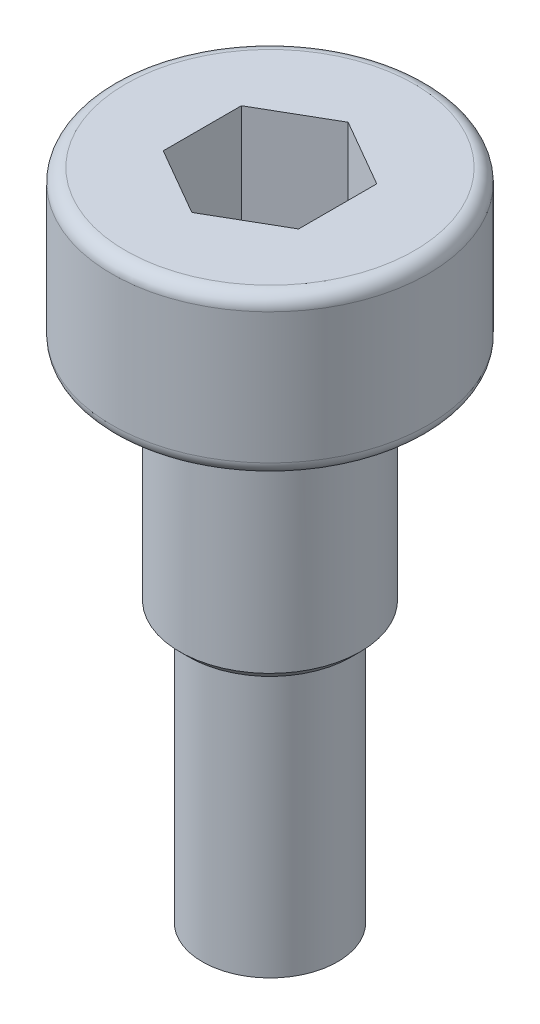
ISO-10303-21;
HEADER;
FILE_DESCRIPTION(('STEP AP214'),'2;1');
FILE_NAME('part.step','',(''),(''),'','','');
FILE_SCHEMA(('AUTOMOTIVE_DESIGN { 1 0 10303 214 1 1 1 1 }'));
ENDSEC;
DATA;
#1=APPLICATION_CONTEXT('core data for automotive mechanical design processes');
#2=APPLICATION_PROTOCOL_DEFINITION('international standard','automotive_design',2000,#1);
#3=PRODUCT_CONTEXT('',#1,'mechanical');
#4=PRODUCT('Part','Part','',(#3));
#5=PRODUCT_RELATED_PRODUCT_CATEGORY('part','',(#4));
#6=PRODUCT_DEFINITION_FORMATION('','',#4);
#7=PRODUCT_DEFINITION_CONTEXT('part definition',#1,'design');
#8=PRODUCT_DEFINITION('design','',#6,#7);
#9=PRODUCT_DEFINITION_SHAPE('','',#8);
#10=(LENGTH_UNIT() NAMED_UNIT(*) SI_UNIT(.MILLI.,.METRE.));
#11=(NAMED_UNIT(*) PLANE_ANGLE_UNIT() SI_UNIT($,.RADIAN.));
#12=(NAMED_UNIT(*) SI_UNIT($,.STERADIAN.) SOLID_ANGLE_UNIT());
#13=UNCERTAINTY_MEASURE_WITH_UNIT(LENGTH_MEASURE(1.E-05),#10,'distance_accuracy_value','');
#14=(GEOMETRIC_REPRESENTATION_CONTEXT(3) GLOBAL_UNCERTAINTY_ASSIGNED_CONTEXT((#13)) GLOBAL_UNIT_ASSIGNED_CONTEXT((#10,
#11,#12)) REPRESENTATION_CONTEXT('',''));
#15=CARTESIAN_POINT('',(0.,0.,0.));
#16=DIRECTION('',(0.,0.,1.));
#17=DIRECTION('',(1.,0.,0.));
#18=AXIS2_PLACEMENT_3D('',#15,#16,#17);
#19=CARTESIAN_POINT('',(0.,3.5,0.));
#20=DIRECTION('',(0.,1.,0.));
#21=DIRECTION('',(-1.,0.,0.));
#22=AXIS2_PLACEMENT_3D('',#19,#20,#21);
#23=PLANE('',#22);
#24=DIRECTION('',(0.,0.,-1.));
#25=VECTOR('',#24,1.);
#26=CARTESIAN_POINT('',(1.5,3.5,0.866025403784437));
#27=LINE('',#26,#25);
#28=CARTESIAN_POINT('',(1.5,3.5,0.866025403784437));
#29=VERTEX_POINT('',#28);
#30=CARTESIAN_POINT('',(1.5,3.5,-0.866025403784439));
#31=VERTEX_POINT('',#30);
#32=EDGE_CURVE('E64',#29,#31,#27,.T.);
#33=ORIENTED_EDGE('',*,*,#32,.F.);
#34=DIRECTION('',(0.866025403784439,0.,-0.5));
#35=VECTOR('',#34,1.);
#36=CARTESIAN_POINT('',(0.,3.5,1.73205080756888));
#37=LINE('',#36,#35);
#38=CARTESIAN_POINT('',(0.,3.5,1.73205080756888));
#39=VERTEX_POINT('',#38);
#40=EDGE_CURVE('E157',#39,#29,#37,.T.);
#41=ORIENTED_EDGE('',*,*,#40,.F.);
#42=DIRECTION('',(0.866025403784439,0.,0.5));
#43=VECTOR('',#42,1.);
#44=CARTESIAN_POINT('',(-1.5,3.5,0.866025403784438));
#45=LINE('',#44,#43);
#46=CARTESIAN_POINT('',(-1.5,3.5,0.866025403784438));
#47=VERTEX_POINT('',#46);
#48=EDGE_CURVE('E154',#47,#39,#45,.T.);
#49=ORIENTED_EDGE('',*,*,#48,.F.);
#50=DIRECTION('',(0.,0.,1.));
#51=VECTOR('',#50,1.);
#52=CARTESIAN_POINT('',(-1.5,3.5,-0.866025403784438));
#53=LINE('',#52,#51);
#54=CARTESIAN_POINT('',(-1.5,3.5,-0.866025403784438));
#55=VERTEX_POINT('',#54);
#56=EDGE_CURVE('E112',#55,#47,#53,.T.);
#57=ORIENTED_EDGE('',*,*,#56,.F.);
#58=DIRECTION('',(-0.866025403784439,0.,0.5));
#59=VECTOR('',#58,1.);
#60=CARTESIAN_POINT('',(0.,3.5,-1.73205080756888));
#61=LINE('',#60,#59);
#62=CARTESIAN_POINT('',(0.,3.5,-1.73205080756888));
#63=VERTEX_POINT('',#62);
#64=EDGE_CURVE('E148',#63,#55,#61,.T.);
#65=ORIENTED_EDGE('',*,*,#64,.F.);
#66=DIRECTION('',(-0.866025403784439,0.,-0.5));
#67=VECTOR('',#66,1.);
#68=CARTESIAN_POINT('',(1.5,3.5,-0.866025403784439));
#69=LINE('',#68,#67);
#70=EDGE_CURVE('E144',#31,#63,#69,.T.);
#71=ORIENTED_EDGE('',*,*,#70,.F.);
#72=EDGE_LOOP('',(#33,#41,#49,#57,#65,#71));
#73=FACE_BOUND('',#72,.T.);
#74=CARTESIAN_POINT('',(0.,3.5,0.));
#75=DIRECTION('',(0.,1.,0.));
#76=DIRECTION('',(-1.,0.,0.));
#77=AXIS2_PLACEMENT_3D('',#74,#75,#76);
#78=CIRCLE('',#77,3.2);
#79=CARTESIAN_POINT('',(-3.2,3.5,0.));
#80=VERTEX_POINT('',#79);
#81=EDGE_CURVE('E196',#80,#80,#78,.T.);
#82=ORIENTED_EDGE('',*,*,#81,.T.);
#83=EDGE_LOOP('',(#82));
#84=FACE_BOUND('',#83,.T.);
#85=ADVANCED_FACE('F47',(#73,#84),#23,.T.);
#86=CARTESIAN_POINT('',(0.,3.5,0.));
#87=DIRECTION('',(0.,1.,0.));
#88=DIRECTION('',(-1.,0.,0.));
#89=AXIS2_PLACEMENT_3D('',#86,#87,#88);
#90=CYLINDRICAL_SURFACE('',#89,3.5);
#91=CARTESIAN_POINT('',(0.,0.3,0.));
#92=DIRECTION('',(0.,-1.,0.));
#93=DIRECTION('',(1.,0.,0.));
#94=AXIS2_PLACEMENT_3D('',#91,#92,#93);
#95=CIRCLE('',#94,3.5);
#96=CARTESIAN_POINT('',(3.5,0.300000000000001,0.));
#97=VERTEX_POINT('',#96);
#98=EDGE_CURVE('E188',#97,#97,#95,.F.);
#99=ORIENTED_EDGE('',*,*,#98,.T.);
#100=EDGE_LOOP('',(#99));
#101=FACE_BOUND('',#100,.T.);
#102=CARTESIAN_POINT('',(0.,3.2,0.));
#103=DIRECTION('',(0.,1.,0.));
#104=DIRECTION('',(-1.,0.,0.));
#105=AXIS2_PLACEMENT_3D('',#102,#103,#104);
#106=CIRCLE('',#105,3.5);
#107=CARTESIAN_POINT('',(-3.5,3.2,0.));
#108=VERTEX_POINT('',#107);
#109=EDGE_CURVE('E184',#108,#108,#106,.F.);
#110=ORIENTED_EDGE('',*,*,#109,.T.);
#111=EDGE_LOOP('',(#110));
#112=FACE_BOUND('',#111,.T.);
#113=ADVANCED_FACE('F215',(#101,#112),#90,.T.);
#114=CARTESIAN_POINT('',(-3.5,0.,0.));
#115=DIRECTION('',(0.,-1.,0.));
#116=DIRECTION('',(1.,0.,0.));
#117=AXIS2_PLACEMENT_3D('',#114,#115,#116);
#118=PLANE('',#117);
#119=CARTESIAN_POINT('',(0.,0.,0.));
#120=DIRECTION('',(0.,-1.,0.));
#121=DIRECTION('',(1.,0.,0.));
#122=AXIS2_PLACEMENT_3D('',#119,#120,#121);
#123=CIRCLE('',#122,3.2);
#124=CARTESIAN_POINT('',(3.2,0.,0.));
#125=VERTEX_POINT('',#124);
#126=EDGE_CURVE('E192',#125,#125,#123,.T.);
#127=ORIENTED_EDGE('',*,*,#126,.T.);
#128=EDGE_LOOP('',(#127));
#129=FACE_BOUND('',#128,.T.);
#130=CARTESIAN_POINT('',(0.,0.,0.));
#131=DIRECTION('',(0.,1.,0.));
#132=DIRECTION('',(-1.,0.,0.));
#133=AXIS2_PLACEMENT_3D('',#130,#131,#132);
#134=CIRCLE('',#133,2.);
#135=CARTESIAN_POINT('',(-2.,0.,0.));
#136=VERTEX_POINT('',#135);
#137=EDGE_CURVE('E180',#136,#136,#134,.T.);
#138=ORIENTED_EDGE('',*,*,#137,.T.);
#139=EDGE_LOOP('',(#138));
#140=FACE_BOUND('',#139,.T.);
#141=ADVANCED_FACE('F221',(#129,#140),#118,.T.);
#142=CARTESIAN_POINT('',(0.,3.5,0.));
#143=DIRECTION('',(0.,1.,0.));
#144=DIRECTION('',(-1.,0.,0.));
#145=AXIS2_PLACEMENT_3D('',#142,#143,#144);
#146=CYLINDRICAL_SURFACE('',#145,2.);
#147=CARTESIAN_POINT('',(0.,-4.8,0.));
#148=DIRECTION('',(0.,-1.,0.));
#149=DIRECTION('',(1.,0.,0.));
#150=AXIS2_PLACEMENT_3D('',#147,#148,#149);
#151=CIRCLE('',#150,2.);
#152=CARTESIAN_POINT('',(2.,-4.8,0.));
#153=VERTEX_POINT('',#152);
#154=EDGE_CURVE('E57',#153,#153,#151,.F.);
#155=ORIENTED_EDGE('',*,*,#154,.T.);
#156=EDGE_LOOP('',(#155));
#157=FACE_BOUND('',#156,.T.);
#158=ORIENTED_EDGE('',*,*,#137,.F.);
#159=EDGE_LOOP('',(#158));
#160=FACE_BOUND('',#159,.T.);
#161=ADVANCED_FACE('F203',(#157,#160),#146,.T.);
#162=CARTESIAN_POINT('',(-2.,-5.,0.));
#163=DIRECTION('',(0.,-1.,0.));
#164=DIRECTION('',(1.,0.,0.));
#165=AXIS2_PLACEMENT_3D('',#162,#163,#164);
#166=PLANE('',#165);
#167=CARTESIAN_POINT('',(0.,-5.,0.));
#168=DIRECTION('',(0.,-1.,0.));
#169=DIRECTION('',(1.,0.,0.));
#170=AXIS2_PLACEMENT_3D('',#167,#168,#169);
#171=CIRCLE('',#170,1.8);
#172=CARTESIAN_POINT('',(1.8,-5.,0.));
#173=VERTEX_POINT('',#172);
#174=EDGE_CURVE('E11',#173,#173,#171,.T.);
#175=ORIENTED_EDGE('',*,*,#174,.T.);
#176=EDGE_LOOP('',(#175));
#177=FACE_BOUND('',#176,.T.);
#178=CARTESIAN_POINT('',(0.,-5.,0.));
#179=DIRECTION('',(0.,1.,0.));
#180=DIRECTION('',(-1.,0.,0.));
#181=AXIS2_PLACEMENT_3D('',#178,#179,#180);
#182=CIRCLE('',#181,1.5);
#183=CARTESIAN_POINT('',(-1.5,-5.,0.));
#184=VERTEX_POINT('',#183);
#185=EDGE_CURVE('E176',#184,#184,#182,.T.);
#186=ORIENTED_EDGE('',*,*,#185,.T.);
#187=EDGE_LOOP('',(#186));
#188=FACE_BOUND('',#187,.T.);
#189=ADVANCED_FACE('F257',(#177,#188),#166,.T.);
#190=CARTESIAN_POINT('',(0.,3.5,0.));
#191=DIRECTION('',(0.,1.,0.));
#192=DIRECTION('',(-1.,0.,0.));
#193=AXIS2_PLACEMENT_3D('',#190,#191,#192);
#194=CYLINDRICAL_SURFACE('',#193,1.5);
#195=CARTESIAN_POINT('',(0.,-11.,0.));
#196=DIRECTION('',(0.,1.,0.));
#197=DIRECTION('',(-1.,0.,0.));
#198=AXIS2_PLACEMENT_3D('',#195,#196,#197);
#199=CIRCLE('',#198,1.5);
#200=CARTESIAN_POINT('',(-1.5,-11.,0.));
#201=VERTEX_POINT('',#200);
#202=EDGE_CURVE('E163',#201,#201,#199,.T.);
#203=ORIENTED_EDGE('',*,*,#202,.T.);
#204=EDGE_LOOP('',(#203));
#205=FACE_BOUND('',#204,.T.);
#206=ORIENTED_EDGE('',*,*,#185,.F.);
#207=EDGE_LOOP('',(#206));
#208=FACE_BOUND('',#207,.T.);
#209=ADVANCED_FACE('F253',(#205,#208),#194,.T.);
#210=CARTESIAN_POINT('',(-1.5,-11.,0.));
#211=DIRECTION('',(0.,-1.,0.));
#212=DIRECTION('',(1.,0.,0.));
#213=AXIS2_PLACEMENT_3D('',#210,#211,#212);
#214=PLANE('',#213);
#215=ORIENTED_EDGE('',*,*,#202,.F.);
#216=EDGE_LOOP('',(#215));
#217=FACE_BOUND('',#216,.T.);
#218=ADVANCED_FACE('F230',(#217),#214,.T.);
#219=CARTESIAN_POINT('',(0.,0.3,0.));
#220=DIRECTION('',(0.,-1.,0.));
#221=DIRECTION('',(1.,0.,0.));
#222=AXIS2_PLACEMENT_3D('',#219,#220,#221);
#223=TOROIDAL_SURFACE('',#222,3.2,0.3);
#224=ORIENTED_EDGE('',*,*,#126,.F.);
#225=EDGE_LOOP('',(#224));
#226=FACE_BOUND('',#225,.T.);
#227=ORIENTED_EDGE('',*,*,#98,.F.);
#228=EDGE_LOOP('',(#227));
#229=FACE_BOUND('',#228,.T.);
#230=ADVANCED_FACE('F227',(#226,#229),#223,.T.);
#231=CARTESIAN_POINT('',(0.,3.2,0.));
#232=DIRECTION('',(0.,1.,0.));
#233=DIRECTION('',(-1.,0.,0.));
#234=AXIS2_PLACEMENT_3D('',#231,#232,#233);
#235=TOROIDAL_SURFACE('',#234,3.2,0.3);
#236=ORIENTED_EDGE('',*,*,#109,.F.);
#237=EDGE_LOOP('',(#236));
#238=FACE_BOUND('',#237,.T.);
#239=ORIENTED_EDGE('',*,*,#81,.F.);
#240=EDGE_LOOP('',(#239));
#241=FACE_BOUND('',#240,.T.);
#242=ADVANCED_FACE('F229',(#238,#241),#235,.T.);
#243=CARTESIAN_POINT('',(1.5,1.1,0.866025403784437));
#244=DIRECTION('',(1.,0.,0.));
#245=DIRECTION('',(0.,1.,0.));
#246=AXIS2_PLACEMENT_3D('',#243,#244,#245);
#247=PLANE('',#246);
#248=ORIENTED_EDGE('',*,*,#32,.T.);
#249=DIRECTION('',(0.,1.,0.));
#250=VECTOR('',#249,1.);
#251=CARTESIAN_POINT('',(1.5,1.1,-0.866025403784439));
#252=LINE('',#251,#250);
#253=CARTESIAN_POINT('',(1.5,1.1,-0.866025403784439));
#254=VERTEX_POINT('',#253);
#255=EDGE_CURVE('E94',#254,#31,#252,.T.);
#256=ORIENTED_EDGE('',*,*,#255,.F.);
#257=DIRECTION('',(0.,0.,-1.));
#258=VECTOR('',#257,1.);
#259=CARTESIAN_POINT('',(1.5,1.1,0.866025403784437));
#260=LINE('',#259,#258);
#261=CARTESIAN_POINT('',(1.5,1.1,0.866025403784437));
#262=VERTEX_POINT('',#261);
#263=EDGE_CURVE('E160',#262,#254,#260,.T.);
#264=ORIENTED_EDGE('',*,*,#263,.F.);
#265=DIRECTION('',(0.,1.,0.));
#266=VECTOR('',#265,1.);
#267=CARTESIAN_POINT('',(1.5,1.1,0.866025403784437));
#268=LINE('',#267,#266);
#269=EDGE_CURVE('E72',#262,#29,#268,.T.);
#270=ORIENTED_EDGE('',*,*,#269,.T.);
#271=EDGE_LOOP('',(#248,#256,#264,#270));
#272=FACE_BOUND('',#271,.T.);
#273=ADVANCED_FACE('F233',(#272),#247,.F.);
#274=CARTESIAN_POINT('',(0.,1.1,1.73205080756888));
#275=DIRECTION('',(0.5,0.,0.866025403784439));
#276=DIRECTION('',(0.866025403784439,0.,-0.5));
#277=AXIS2_PLACEMENT_3D('',#274,#275,#276);
#278=PLANE('',#277);
#279=ORIENTED_EDGE('',*,*,#40,.T.);
#280=ORIENTED_EDGE('',*,*,#269,.F.);
#281=DIRECTION('',(0.866025403784439,0.,-0.5));
#282=VECTOR('',#281,1.);
#283=CARTESIAN_POINT('',(0.,1.1,1.73205080756888));
#284=LINE('',#283,#282);
#285=CARTESIAN_POINT('',(0.,1.1,1.73205080756888));
#286=VERTEX_POINT('',#285);
#287=EDGE_CURVE('E126',#286,#262,#284,.T.);
#288=ORIENTED_EDGE('',*,*,#287,.F.);
#289=DIRECTION('',(0.,1.,0.));
#290=VECTOR('',#289,1.);
#291=CARTESIAN_POINT('',(0.,1.1,1.73205080756888));
#292=LINE('',#291,#290);
#293=EDGE_CURVE('E117',#286,#39,#292,.T.);
#294=ORIENTED_EDGE('',*,*,#293,.T.);
#295=EDGE_LOOP('',(#279,#280,#288,#294));
#296=FACE_BOUND('',#295,.T.);
#297=ADVANCED_FACE('F238',(#296),#278,.F.);
#298=CARTESIAN_POINT('',(-1.5,1.1,0.866025403784438));
#299=DIRECTION('',(-0.5,0.,0.866025403784438));
#300=DIRECTION('',(0.866025403784439,0.,0.5));
#301=AXIS2_PLACEMENT_3D('',#298,#299,#300);
#302=PLANE('',#301);
#303=ORIENTED_EDGE('',*,*,#48,.T.);
#304=ORIENTED_EDGE('',*,*,#293,.F.);
#305=DIRECTION('',(0.866025403784439,0.,0.5));
#306=VECTOR('',#305,1.);
#307=CARTESIAN_POINT('',(-1.5,1.1,0.866025403784438));
#308=LINE('',#307,#306);
#309=CARTESIAN_POINT('',(-1.5,1.1,0.866025403784438));
#310=VERTEX_POINT('',#309);
#311=EDGE_CURVE('E121',#310,#286,#308,.T.);
#312=ORIENTED_EDGE('',*,*,#311,.F.);
#313=DIRECTION('',(0.,1.,0.));
#314=VECTOR('',#313,1.);
#315=CARTESIAN_POINT('',(-1.5,1.1,0.866025403784438));
#316=LINE('',#315,#314);
#317=EDGE_CURVE('E105',#310,#47,#316,.T.);
#318=ORIENTED_EDGE('',*,*,#317,.T.);
#319=EDGE_LOOP('',(#303,#304,#312,#318));
#320=FACE_BOUND('',#319,.T.);
#321=ADVANCED_FACE('F122',(#320),#302,.F.);
#322=CARTESIAN_POINT('',(-1.5,1.1,-0.866025403784438));
#323=DIRECTION('',(-1.,0.,0.));
#324=DIRECTION('',(0.,0.,1.));
#325=AXIS2_PLACEMENT_3D('',#322,#323,#324);
#326=PLANE('',#325);
#327=ORIENTED_EDGE('',*,*,#56,.T.);
#328=ORIENTED_EDGE('',*,*,#317,.F.);
#329=DIRECTION('',(0.,0.,1.));
#330=VECTOR('',#329,1.);
#331=CARTESIAN_POINT('',(-1.5,1.1,-0.866025403784438));
#332=LINE('',#331,#330);
#333=CARTESIAN_POINT('',(-1.5,1.1,-0.866025403784438));
#334=VERTEX_POINT('',#333);
#335=EDGE_CURVE('E109',#334,#310,#332,.T.);
#336=ORIENTED_EDGE('',*,*,#335,.F.);
#337=DIRECTION('',(0.,1.,0.));
#338=VECTOR('',#337,1.);
#339=CARTESIAN_POINT('',(-1.5,1.1,-0.866025403784438));
#340=LINE('',#339,#338);
#341=EDGE_CURVE('E118',#334,#55,#340,.T.);
#342=ORIENTED_EDGE('',*,*,#341,.T.);
#343=EDGE_LOOP('',(#327,#328,#336,#342));
#344=FACE_BOUND('',#343,.T.);
#345=ADVANCED_FACE('F107',(#344),#326,.F.);
#346=CARTESIAN_POINT('',(0.,1.1,-1.73205080756888));
#347=DIRECTION('',(-0.5,0.,-0.866025403784439));
#348=DIRECTION('',(-0.866025403784439,0.,0.5));
#349=AXIS2_PLACEMENT_3D('',#346,#347,#348);
#350=PLANE('',#349);
#351=ORIENTED_EDGE('',*,*,#64,.T.);
#352=ORIENTED_EDGE('',*,*,#341,.F.);
#353=DIRECTION('',(-0.866025403784439,0.,0.5));
#354=VECTOR('',#353,1.);
#355=CARTESIAN_POINT('',(0.,1.1,-1.73205080756888));
#356=LINE('',#355,#354);
#357=CARTESIAN_POINT('',(0.,1.1,-1.73205080756888));
#358=VERTEX_POINT('',#357);
#359=EDGE_CURVE('E132',#358,#334,#356,.T.);
#360=ORIENTED_EDGE('',*,*,#359,.F.);
#361=DIRECTION('',(0.,1.,0.));
#362=VECTOR('',#361,1.);
#363=CARTESIAN_POINT('',(0.,1.1,-1.73205080756888));
#364=LINE('',#363,#362);
#365=EDGE_CURVE('E168',#358,#63,#364,.T.);
#366=ORIENTED_EDGE('',*,*,#365,.T.);
#367=EDGE_LOOP('',(#351,#352,#360,#366));
#368=FACE_BOUND('',#367,.T.);
#369=ADVANCED_FACE('F333',(#368),#350,.F.);
#370=CARTESIAN_POINT('',(1.5,1.1,-0.866025403784439));
#371=DIRECTION('',(0.5,0.,-0.866025403784439));
#372=DIRECTION('',(-0.866025403784439,0.,-0.5));
#373=AXIS2_PLACEMENT_3D('',#370,#371,#372);
#374=PLANE('',#373);
#375=ORIENTED_EDGE('',*,*,#70,.T.);
#376=ORIENTED_EDGE('',*,*,#365,.F.);
#377=DIRECTION('',(-0.866025403784439,0.,-0.5));
#378=VECTOR('',#377,1.);
#379=CARTESIAN_POINT('',(1.5,1.1,-0.866025403784439));
#380=LINE('',#379,#378);
#381=EDGE_CURVE('E136',#254,#358,#380,.T.);
#382=ORIENTED_EDGE('',*,*,#381,.F.);
#383=ORIENTED_EDGE('',*,*,#255,.T.);
#384=EDGE_LOOP('',(#375,#376,#382,#383));
#385=FACE_BOUND('',#384,.T.);
#386=ADVANCED_FACE('F211',(#385),#374,.F.);
#387=CARTESIAN_POINT('',(0.,1.1,0.));
#388=DIRECTION('',(0.,1.,0.));
#389=DIRECTION('',(0.,0.,1.));
#390=AXIS2_PLACEMENT_3D('',#387,#388,#389);
#391=PLANE('',#390);
#392=ORIENTED_EDGE('',*,*,#263,.T.);
#393=ORIENTED_EDGE('',*,*,#381,.T.);
#394=ORIENTED_EDGE('',*,*,#359,.T.);
#395=ORIENTED_EDGE('',*,*,#335,.T.);
#396=ORIENTED_EDGE('',*,*,#311,.T.);
#397=ORIENTED_EDGE('',*,*,#287,.T.);
#398=EDGE_LOOP('',(#392,#393,#394,#395,#396,#397));
#399=FACE_BOUND('',#398,.T.);
#400=ADVANCED_FACE('F129',(#399),#391,.T.);
#401=CARTESIAN_POINT('',(0.,-4.8,0.));
#402=DIRECTION('',(0.,1.,0.));
#403=DIRECTION('',(-1.,0.,0.));
#404=AXIS2_PLACEMENT_3D('',#401,#402,#403);
#405=CONICAL_SURFACE('',#404,2.,0.785398163397455);
#406=ORIENTED_EDGE('',*,*,#174,.F.);
#407=EDGE_LOOP('',(#406));
#408=FACE_BOUND('',#407,.T.);
#409=ORIENTED_EDGE('',*,*,#154,.F.);
#410=EDGE_LOOP('',(#409));
#411=FACE_BOUND('',#410,.T.);
#412=ADVANCED_FACE('F50',(#408,#411),#405,.T.);
#413=CLOSED_SHELL('',(#85,#113,#141,#161,#189,#209,#218,#230,#242,#273,#297,#321,#345,#369,#386,
#400,#412));
#414=MANIFOLD_SOLID_BREP('B2',#413);
#415=ADVANCED_BREP_SHAPE_REPRESENTATION('',(#18,#414),#14);
#416=SHAPE_DEFINITION_REPRESENTATION(#9,#415);
ENDSEC;
END-ISO-10303-21;
